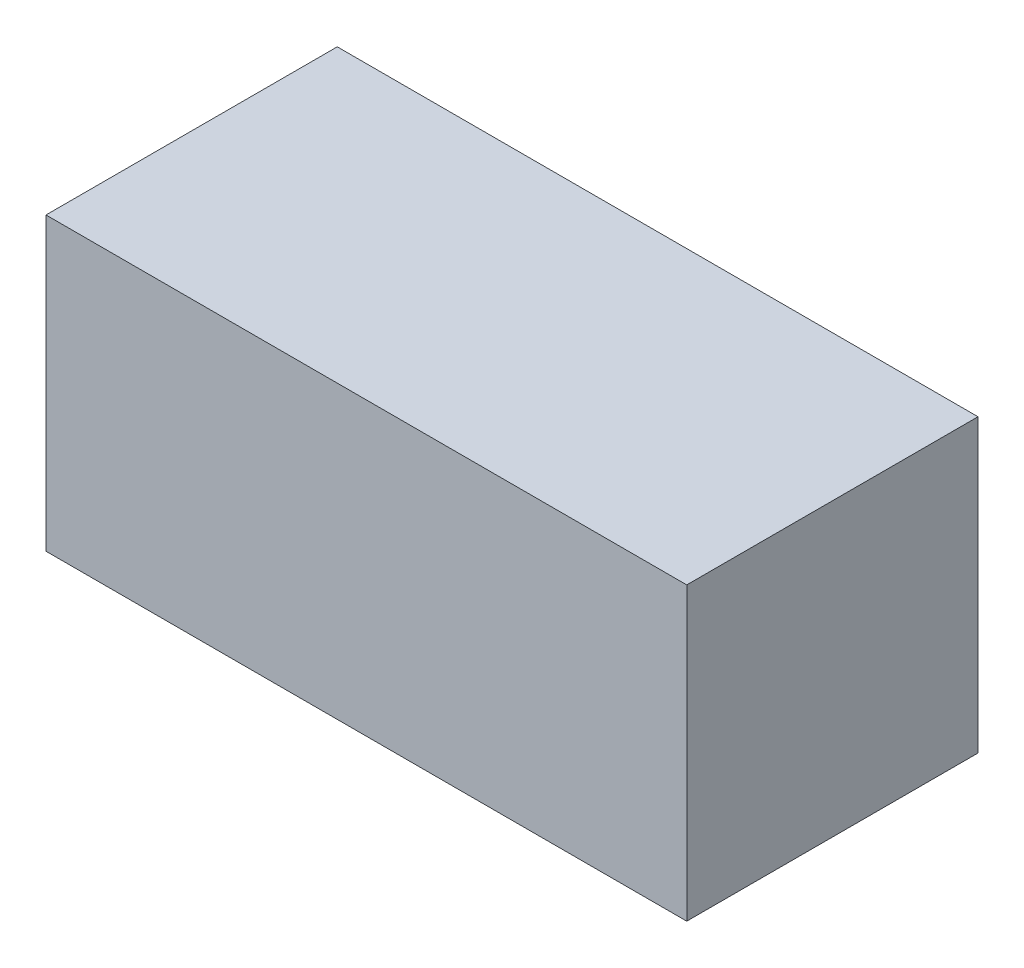
ISO-10303-21;
HEADER;
FILE_DESCRIPTION(('STEP AP214'),'2;1');
FILE_NAME('part.step','',(''),(''),'','','');
FILE_SCHEMA(('AUTOMOTIVE_DESIGN { 1 0 10303 214 1 1 1 1 }'));
ENDSEC;
DATA;
#1=APPLICATION_CONTEXT('core data for automotive mechanical design processes');
#2=APPLICATION_PROTOCOL_DEFINITION('international standard','automotive_design',2000,#1);
#3=PRODUCT_CONTEXT('',#1,'mechanical');
#4=PRODUCT('Part','Part','',(#3));
#5=PRODUCT_RELATED_PRODUCT_CATEGORY('part','',(#4));
#6=PRODUCT_DEFINITION_FORMATION('','',#4);
#7=PRODUCT_DEFINITION_CONTEXT('part definition',#1,'design');
#8=PRODUCT_DEFINITION('design','',#6,#7);
#9=PRODUCT_DEFINITION_SHAPE('','',#8);
#10=(LENGTH_UNIT() NAMED_UNIT(*) SI_UNIT(.MILLI.,.METRE.));
#11=(NAMED_UNIT(*) PLANE_ANGLE_UNIT() SI_UNIT($,.RADIAN.));
#12=(NAMED_UNIT(*) SI_UNIT($,.STERADIAN.) SOLID_ANGLE_UNIT());
#13=UNCERTAINTY_MEASURE_WITH_UNIT(LENGTH_MEASURE(1.E-05),#10,'distance_accuracy_value','');
#14=(GEOMETRIC_REPRESENTATION_CONTEXT(3) GLOBAL_UNCERTAINTY_ASSIGNED_CONTEXT((#13)) GLOBAL_UNIT_ASSIGNED_CONTEXT((#10,
#11,#12)) REPRESENTATION_CONTEXT('',''));
#15=CARTESIAN_POINT('',(0.,0.,0.));
#16=DIRECTION('',(0.,0.,1.));
#17=DIRECTION('',(1.,0.,0.));
#18=AXIS2_PLACEMENT_3D('',#15,#16,#17);
#19=CARTESIAN_POINT('',(83.82,38.1,76.2));
#20=DIRECTION('',(-1.,0.,0.));
#21=DIRECTION('',(0.,0.,1.));
#22=AXIS2_PLACEMENT_3D('',#19,#20,#21);
#23=PLANE('',#22);
#24=DIRECTION('',(0.,1.,0.));
#25=VECTOR('',#24,1.);
#26=CARTESIAN_POINT('',(83.82,38.1,0.));
#27=LINE('',#26,#25);
#28=CARTESIAN_POINT('',(83.82,-38.1,0.));
#29=VERTEX_POINT('',#28);
#30=CARTESIAN_POINT('',(83.82,38.1,0.));
#31=VERTEX_POINT('',#30);
#32=EDGE_CURVE('E99',#29,#31,#27,.T.);
#33=ORIENTED_EDGE('',*,*,#32,.T.);
#34=DIRECTION('',(0.,0.,-1.));
#35=VECTOR('',#34,1.);
#36=CARTESIAN_POINT('',(83.82,38.1,76.2));
#37=LINE('',#36,#35);
#38=CARTESIAN_POINT('',(83.82,38.1,76.2));
#39=VERTEX_POINT('',#38);
#40=EDGE_CURVE('E11',#39,#31,#37,.T.);
#41=ORIENTED_EDGE('',*,*,#40,.F.);
#42=DIRECTION('',(0.,1.,0.));
#43=VECTOR('',#42,1.);
#44=CARTESIAN_POINT('',(83.82,38.1,76.2));
#45=LINE('',#44,#43);
#46=CARTESIAN_POINT('',(83.82,-38.1,76.2));
#47=VERTEX_POINT('',#46);
#48=EDGE_CURVE('E87',#47,#39,#45,.T.);
#49=ORIENTED_EDGE('',*,*,#48,.F.);
#50=DIRECTION('',(0.,0.,-1.));
#51=VECTOR('',#50,1.);
#52=CARTESIAN_POINT('',(83.82,-38.1,76.2));
#53=LINE('',#52,#51);
#54=EDGE_CURVE('E95',#47,#29,#53,.T.);
#55=ORIENTED_EDGE('',*,*,#54,.T.);
#56=EDGE_LOOP('',(#33,#41,#49,#55));
#57=FACE_BOUND('',#56,.T.);
#58=ADVANCED_FACE('F36',(#57),#23,.F.);
#59=CARTESIAN_POINT('',(-83.82,38.1,76.2));
#60=DIRECTION('',(0.,-1.,0.));
#61=DIRECTION('',(0.,0.,-1.));
#62=AXIS2_PLACEMENT_3D('',#59,#60,#61);
#63=PLANE('',#62);
#64=DIRECTION('',(-1.,0.,0.));
#65=VECTOR('',#64,1.);
#66=CARTESIAN_POINT('',(-83.82,38.1,0.));
#67=LINE('',#66,#65);
#68=CARTESIAN_POINT('',(-83.82,38.1,0.));
#69=VERTEX_POINT('',#68);
#70=EDGE_CURVE('E91',#31,#69,#67,.T.);
#71=ORIENTED_EDGE('',*,*,#70,.T.);
#72=DIRECTION('',(0.,0.,-1.));
#73=VECTOR('',#72,1.);
#74=CARTESIAN_POINT('',(-83.82,38.1,76.2));
#75=LINE('',#74,#73);
#76=CARTESIAN_POINT('',(-83.82,38.1,76.2));
#77=VERTEX_POINT('',#76);
#78=EDGE_CURVE('E44',#77,#69,#75,.T.);
#79=ORIENTED_EDGE('',*,*,#78,.F.);
#80=DIRECTION('',(-1.,0.,0.));
#81=VECTOR('',#80,1.);
#82=CARTESIAN_POINT('',(-83.82,38.1,76.2));
#83=LINE('',#82,#81);
#84=EDGE_CURVE('E82',#39,#77,#83,.T.);
#85=ORIENTED_EDGE('',*,*,#84,.F.);
#86=ORIENTED_EDGE('',*,*,#40,.T.);
#87=EDGE_LOOP('',(#71,#79,#85,#86));
#88=FACE_BOUND('',#87,.T.);
#89=ADVANCED_FACE('F90',(#88),#63,.F.);
#90=CARTESIAN_POINT('',(-83.82,38.1,76.2));
#91=DIRECTION('',(1.,0.,0.));
#92=DIRECTION('',(0.,1.,0.));
#93=AXIS2_PLACEMENT_3D('',#90,#91,#92);
#94=PLANE('',#93);
#95=DIRECTION('',(0.,-1.,0.));
#96=VECTOR('',#95,1.);
#97=CARTESIAN_POINT('',(-83.82,38.1,0.));
#98=LINE('',#97,#96);
#99=CARTESIAN_POINT('',(-83.82,-38.1,0.));
#100=VERTEX_POINT('',#99);
#101=EDGE_CURVE('E69',#69,#100,#98,.T.);
#102=ORIENTED_EDGE('',*,*,#101,.T.);
#103=DIRECTION('',(0.,0.,-1.));
#104=VECTOR('',#103,1.);
#105=CARTESIAN_POINT('',(-83.82,-38.1,76.2));
#106=LINE('',#105,#104);
#107=CARTESIAN_POINT('',(-83.82,-38.1,76.2));
#108=VERTEX_POINT('',#107);
#109=EDGE_CURVE('E92',#108,#100,#106,.T.);
#110=ORIENTED_EDGE('',*,*,#109,.F.);
#111=DIRECTION('',(0.,-1.,0.));
#112=VECTOR('',#111,1.);
#113=CARTESIAN_POINT('',(-83.82,38.1,76.2));
#114=LINE('',#113,#112);
#115=EDGE_CURVE('E85',#77,#108,#114,.T.);
#116=ORIENTED_EDGE('',*,*,#115,.F.);
#117=ORIENTED_EDGE('',*,*,#78,.T.);
#118=EDGE_LOOP('',(#102,#110,#116,#117));
#119=FACE_BOUND('',#118,.T.);
#120=ADVANCED_FACE('F93',(#119),#94,.F.);
#121=CARTESIAN_POINT('',(-83.82,-38.1,76.2));
#122=DIRECTION('',(0.,1.,0.));
#123=DIRECTION('',(0.,0.,1.));
#124=AXIS2_PLACEMENT_3D('',#121,#122,#123);
#125=PLANE('',#124);
#126=DIRECTION('',(1.,0.,0.));
#127=VECTOR('',#126,1.);
#128=CARTESIAN_POINT('',(-83.82,-38.1,0.));
#129=LINE('',#128,#127);
#130=EDGE_CURVE('E75',#100,#29,#129,.T.);
#131=ORIENTED_EDGE('',*,*,#130,.T.);
#132=ORIENTED_EDGE('',*,*,#54,.F.);
#133=DIRECTION('',(1.,0.,0.));
#134=VECTOR('',#133,1.);
#135=CARTESIAN_POINT('',(-83.82,-38.1,76.2));
#136=LINE('',#135,#134);
#137=EDGE_CURVE('E52',#108,#47,#136,.T.);
#138=ORIENTED_EDGE('',*,*,#137,.F.);
#139=ORIENTED_EDGE('',*,*,#109,.T.);
#140=EDGE_LOOP('',(#131,#132,#138,#139));
#141=FACE_BOUND('',#140,.T.);
#142=ADVANCED_FACE('F106',(#141),#125,.F.);
#143=CARTESIAN_POINT('',(0.,0.,76.2));
#144=DIRECTION('',(0.,0.,1.));
#145=DIRECTION('',(1.,0.,0.));
#146=AXIS2_PLACEMENT_3D('',#143,#144,#145);
#147=PLANE('',#146);
#148=ORIENTED_EDGE('',*,*,#48,.T.);
#149=ORIENTED_EDGE('',*,*,#84,.T.);
#150=ORIENTED_EDGE('',*,*,#115,.T.);
#151=ORIENTED_EDGE('',*,*,#137,.T.);
#152=EDGE_LOOP('',(#148,#149,#150,#151));
#153=FACE_BOUND('',#152,.T.);
#154=ADVANCED_FACE('F83',(#153),#147,.T.);
#155=CARTESIAN_POINT('',(0.,0.,0.));
#156=DIRECTION('',(0.,0.,1.));
#157=DIRECTION('',(1.,0.,0.));
#158=AXIS2_PLACEMENT_3D('',#155,#156,#157);
#159=PLANE('',#158);
#160=ORIENTED_EDGE('',*,*,#32,.F.);
#161=ORIENTED_EDGE('',*,*,#130,.F.);
#162=ORIENTED_EDGE('',*,*,#101,.F.);
#163=ORIENTED_EDGE('',*,*,#70,.F.);
#164=EDGE_LOOP('',(#160,#161,#162,#163));
#165=FACE_BOUND('',#164,.T.);
#166=ADVANCED_FACE('F109',(#165),#159,.F.);
#167=CLOSED_SHELL('',(#58,#89,#120,#142,#154,#166));
#168=MANIFOLD_SOLID_BREP('B2',#167);
#169=ADVANCED_BREP_SHAPE_REPRESENTATION('',(#18,#168),#14);
#170=SHAPE_DEFINITION_REPRESENTATION(#9,#169);
ENDSEC;
END-ISO-10303-21;
